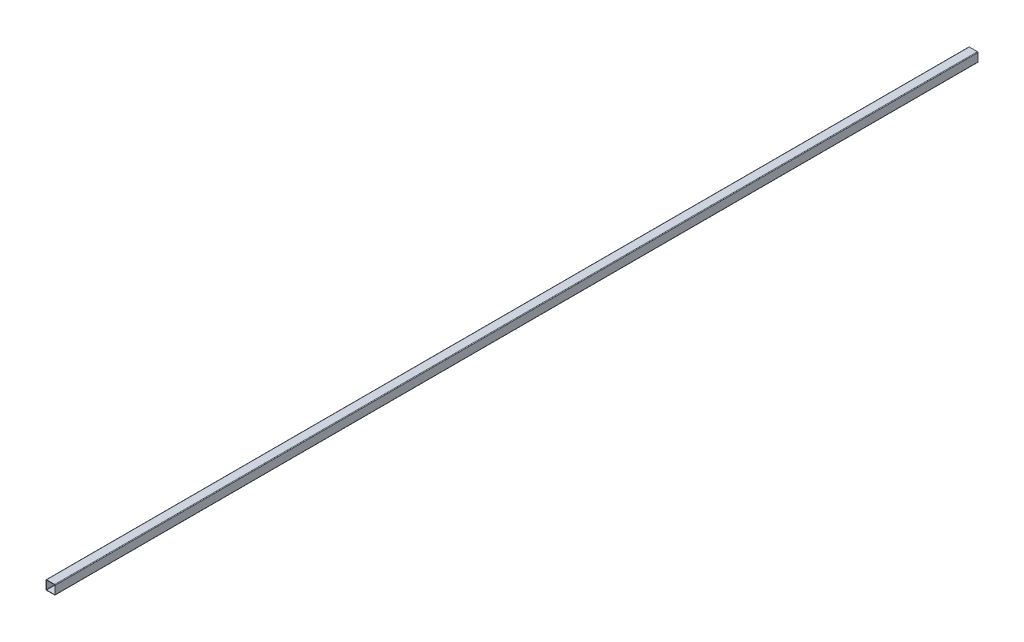
ISO-10303-21;
HEADER;
FILE_DESCRIPTION(('STEP AP214'),'2;1');
FILE_NAME('part.step','',(''),(''),'','','');
FILE_SCHEMA(('AUTOMOTIVE_DESIGN { 1 0 10303 214 1 1 1 1 }'));
ENDSEC;
DATA;
#1=APPLICATION_CONTEXT('core data for automotive mechanical design processes');
#2=APPLICATION_PROTOCOL_DEFINITION('international standard','automotive_design',2000,#1);
#3=PRODUCT_CONTEXT('',#1,'mechanical');
#4=PRODUCT('Part','Part','',(#3));
#5=PRODUCT_RELATED_PRODUCT_CATEGORY('part','',(#4));
#6=PRODUCT_DEFINITION_FORMATION('','',#4);
#7=PRODUCT_DEFINITION_CONTEXT('part definition',#1,'design');
#8=PRODUCT_DEFINITION('design','',#6,#7);
#9=PRODUCT_DEFINITION_SHAPE('','',#8);
#10=(LENGTH_UNIT() NAMED_UNIT(*) SI_UNIT(.MILLI.,.METRE.));
#11=(NAMED_UNIT(*) PLANE_ANGLE_UNIT() SI_UNIT($,.RADIAN.));
#12=(NAMED_UNIT(*) SI_UNIT($,.STERADIAN.) SOLID_ANGLE_UNIT());
#13=UNCERTAINTY_MEASURE_WITH_UNIT(LENGTH_MEASURE(1.E-05),#10,'distance_accuracy_value','');
#14=(GEOMETRIC_REPRESENTATION_CONTEXT(3) GLOBAL_UNCERTAINTY_ASSIGNED_CONTEXT((#13)) GLOBAL_UNIT_ASSIGNED_CONTEXT((#10,
#11,#12)) REPRESENTATION_CONTEXT('',''));
#15=CARTESIAN_POINT('',(0.,0.,0.));
#16=DIRECTION('',(0.,0.,1.));
#17=DIRECTION('',(1.,0.,0.));
#18=AXIS2_PLACEMENT_3D('',#15,#16,#17);
#19=CARTESIAN_POINT('',(-13.,-13.,3000.));
#20=DIRECTION('',(0.,0.,1.));
#21=DIRECTION('',(1.,0.,0.));
#22=AXIS2_PLACEMENT_3D('',#19,#20,#21);
#23=PLANE('',#22);
#24=CARTESIAN_POINT('',(-13.,-13.,3000.));
#25=DIRECTION('',(0.,0.,1.));
#26=DIRECTION('',(1.,0.,0.));
#27=AXIS2_PLACEMENT_3D('',#24,#25,#26);
#28=CIRCLE('',#27,1.99999999999999);
#29=CARTESIAN_POINT('',(-15.,-13.,3000.));
#30=VERTEX_POINT('',#29);
#31=CARTESIAN_POINT('',(-13.,-15.,3000.));
#32=VERTEX_POINT('',#31);
#33=EDGE_CURVE('E242',#30,#32,#28,.T.);
#34=ORIENTED_EDGE('',*,*,#33,.T.);
#35=DIRECTION('',(1.,0.,0.));
#36=VECTOR('',#35,1.);
#37=CARTESIAN_POINT('',(-13.,-15.,3000.));
#38=LINE('',#37,#36);
#39=CARTESIAN_POINT('',(13.,-15.,3000.));
#40=VERTEX_POINT('',#39);
#41=EDGE_CURVE('E246',#32,#40,#38,.T.);
#42=ORIENTED_EDGE('',*,*,#41,.T.);
#43=CARTESIAN_POINT('',(13.,-13.,3000.));
#44=DIRECTION('',(0.,0.,1.));
#45=DIRECTION('',(1.,0.,0.));
#46=AXIS2_PLACEMENT_3D('',#43,#44,#45);
#47=CIRCLE('',#46,1.99999999999998);
#48=CARTESIAN_POINT('',(15.,-13.,3000.));
#49=VERTEX_POINT('',#48);
#50=EDGE_CURVE('E250',#40,#49,#47,.T.);
#51=ORIENTED_EDGE('',*,*,#50,.T.);
#52=DIRECTION('',(0.,1.,0.));
#53=VECTOR('',#52,1.);
#54=CARTESIAN_POINT('',(15.,13.,3000.));
#55=LINE('',#54,#53);
#56=CARTESIAN_POINT('',(15.,13.,3000.));
#57=VERTEX_POINT('',#56);
#58=EDGE_CURVE('E253',#49,#57,#55,.T.);
#59=ORIENTED_EDGE('',*,*,#58,.T.);
#60=CARTESIAN_POINT('',(13.,13.,3000.));
#61=DIRECTION('',(0.,0.,1.));
#62=DIRECTION('',(-1.,0.,0.));
#63=AXIS2_PLACEMENT_3D('',#60,#61,#62);
#64=CIRCLE('',#63,1.99999999999998);
#65=CARTESIAN_POINT('',(13.,15.,3000.));
#66=VERTEX_POINT('',#65);
#67=EDGE_CURVE('E256',#57,#66,#64,.T.);
#68=ORIENTED_EDGE('',*,*,#67,.T.);
#69=DIRECTION('',(-1.,0.,0.));
#70=VECTOR('',#69,1.);
#71=CARTESIAN_POINT('',(-13.,15.,3000.));
#72=LINE('',#71,#70);
#73=CARTESIAN_POINT('',(-13.,15.,3000.));
#74=VERTEX_POINT('',#73);
#75=EDGE_CURVE('E259',#66,#74,#72,.T.);
#76=ORIENTED_EDGE('',*,*,#75,.T.);
#77=CARTESIAN_POINT('',(-13.,13.,3000.));
#78=DIRECTION('',(0.,0.,1.));
#79=DIRECTION('',(1.,0.,0.));
#80=AXIS2_PLACEMENT_3D('',#77,#78,#79);
#81=CIRCLE('',#80,2.);
#82=CARTESIAN_POINT('',(-15.,13.,3000.));
#83=VERTEX_POINT('',#82);
#84=EDGE_CURVE('E262',#74,#83,#81,.T.);
#85=ORIENTED_EDGE('',*,*,#84,.T.);
#86=DIRECTION('',(0.,-1.,0.));
#87=VECTOR('',#86,1.);
#88=CARTESIAN_POINT('',(-15.,13.,3000.));
#89=LINE('',#88,#87);
#90=EDGE_CURVE('E265',#83,#30,#89,.T.);
#91=ORIENTED_EDGE('',*,*,#90,.T.);
#92=EDGE_LOOP('',(#34,#42,#51,#59,#68,#76,#85,#91));
#93=FACE_BOUND('',#92,.T.);
#94=DIRECTION('',(1.,0.,0.));
#95=VECTOR('',#94,1.);
#96=CARTESIAN_POINT('',(-13.,-14.,3000.));
#97=LINE('',#96,#95);
#98=CARTESIAN_POINT('',(-13.,-14.,3000.));
#99=VERTEX_POINT('',#98);
#100=CARTESIAN_POINT('',(13.,-14.,3000.));
#101=VERTEX_POINT('',#100);
#102=EDGE_CURVE('E162',#99,#101,#97,.T.);
#103=ORIENTED_EDGE('',*,*,#102,.F.);
#104=CARTESIAN_POINT('',(-13.,-13.,3000.));
#105=DIRECTION('',(0.,0.,1.));
#106=DIRECTION('',(1.,0.,0.));
#107=AXIS2_PLACEMENT_3D('',#104,#105,#106);
#108=CIRCLE('',#107,0.999999999999997);
#109=CARTESIAN_POINT('',(-14.,-13.,3000.));
#110=VERTEX_POINT('',#109);
#111=EDGE_CURVE('E153',#110,#99,#108,.T.);
#112=ORIENTED_EDGE('',*,*,#111,.F.);
#113=DIRECTION('',(0.,-1.,0.));
#114=VECTOR('',#113,1.);
#115=CARTESIAN_POINT('',(-14.,13.,3000.));
#116=LINE('',#115,#114);
#117=CARTESIAN_POINT('',(-14.,13.,3000.));
#118=VERTEX_POINT('',#117);
#119=EDGE_CURVE('E194',#118,#110,#116,.T.);
#120=ORIENTED_EDGE('',*,*,#119,.F.);
#121=CARTESIAN_POINT('',(-13.,13.,3000.));
#122=DIRECTION('',(0.,0.,1.));
#123=DIRECTION('',(1.,0.,0.));
#124=AXIS2_PLACEMENT_3D('',#121,#122,#123);
#125=CIRCLE('',#124,1.00000000000002);
#126=CARTESIAN_POINT('',(-13.,14.,3000.));
#127=VERTEX_POINT('',#126);
#128=EDGE_CURVE('E191',#127,#118,#125,.T.);
#129=ORIENTED_EDGE('',*,*,#128,.F.);
#130=DIRECTION('',(-1.,0.,0.));
#131=VECTOR('',#130,1.);
#132=CARTESIAN_POINT('',(-13.,14.,3000.));
#133=LINE('',#132,#131);
#134=CARTESIAN_POINT('',(13.,14.,3000.));
#135=VERTEX_POINT('',#134);
#136=EDGE_CURVE('E188',#135,#127,#133,.T.);
#137=ORIENTED_EDGE('',*,*,#136,.F.);
#138=CARTESIAN_POINT('',(13.,13.,3000.));
#139=DIRECTION('',(0.,0.,1.));
#140=DIRECTION('',(-1.,0.,0.));
#141=AXIS2_PLACEMENT_3D('',#138,#139,#140);
#142=CIRCLE('',#141,1.00000000000003);
#143=CARTESIAN_POINT('',(14.,13.,3000.));
#144=VERTEX_POINT('',#143);
#145=EDGE_CURVE('E185',#144,#135,#142,.T.);
#146=ORIENTED_EDGE('',*,*,#145,.F.);
#147=DIRECTION('',(0.,1.,0.));
#148=VECTOR('',#147,1.);
#149=CARTESIAN_POINT('',(14.,13.,3000.));
#150=LINE('',#149,#148);
#151=CARTESIAN_POINT('',(14.,-13.,3000.));
#152=VERTEX_POINT('',#151);
#153=EDGE_CURVE('E180',#152,#144,#150,.T.);
#154=ORIENTED_EDGE('',*,*,#153,.F.);
#155=CARTESIAN_POINT('',(13.,-13.,3000.));
#156=DIRECTION('',(0.,0.,1.));
#157=DIRECTION('',(1.,0.,0.));
#158=AXIS2_PLACEMENT_3D('',#155,#156,#157);
#159=CIRCLE('',#158,1.00000000000002);
#160=EDGE_CURVE('E176',#101,#152,#159,.T.);
#161=ORIENTED_EDGE('',*,*,#160,.F.);
#162=EDGE_LOOP('',(#103,#112,#120,#129,#137,#146,#154,#161));
#163=FACE_BOUND('',#162,.T.);
#164=ADVANCED_FACE('F39',(#93,#163),#23,.T.);
#165=CARTESIAN_POINT('',(-13.,-13.,0.));
#166=DIRECTION('',(0.,0.,1.));
#167=DIRECTION('',(1.,0.,0.));
#168=AXIS2_PLACEMENT_3D('',#165,#166,#167);
#169=PLANE('',#168);
#170=CARTESIAN_POINT('',(-13.,-13.,0.));
#171=DIRECTION('',(0.,0.,1.));
#172=DIRECTION('',(1.,0.,0.));
#173=AXIS2_PLACEMENT_3D('',#170,#171,#172);
#174=CIRCLE('',#173,1.99999999999999);
#175=CARTESIAN_POINT('',(-15.,-13.,0.));
#176=VERTEX_POINT('',#175);
#177=CARTESIAN_POINT('',(-13.,-15.,0.));
#178=VERTEX_POINT('',#177);
#179=EDGE_CURVE('E171',#176,#178,#174,.T.);
#180=ORIENTED_EDGE('',*,*,#179,.F.);
#181=DIRECTION('',(0.,-1.,0.));
#182=VECTOR('',#181,1.);
#183=CARTESIAN_POINT('',(-15.,13.,0.));
#184=LINE('',#183,#182);
#185=CARTESIAN_POINT('',(-15.,13.,0.));
#186=VERTEX_POINT('',#185);
#187=EDGE_CURVE('E247',#186,#176,#184,.T.);
#188=ORIENTED_EDGE('',*,*,#187,.F.);
#189=CARTESIAN_POINT('',(-13.,13.,0.));
#190=DIRECTION('',(0.,0.,1.));
#191=DIRECTION('',(1.,0.,0.));
#192=AXIS2_PLACEMENT_3D('',#189,#190,#191);
#193=CIRCLE('',#192,2.);
#194=CARTESIAN_POINT('',(-13.,15.,0.));
#195=VERTEX_POINT('',#194);
#196=EDGE_CURVE('E287',#195,#186,#193,.T.);
#197=ORIENTED_EDGE('',*,*,#196,.F.);
#198=DIRECTION('',(-1.,0.,0.));
#199=VECTOR('',#198,1.);
#200=CARTESIAN_POINT('',(-13.,15.,0.));
#201=LINE('',#200,#199);
#202=CARTESIAN_POINT('',(13.,15.,0.));
#203=VERTEX_POINT('',#202);
#204=EDGE_CURVE('E284',#203,#195,#201,.T.);
#205=ORIENTED_EDGE('',*,*,#204,.F.);
#206=CARTESIAN_POINT('',(13.,13.,0.));
#207=DIRECTION('',(0.,0.,1.));
#208=DIRECTION('',(-1.,0.,0.));
#209=AXIS2_PLACEMENT_3D('',#206,#207,#208);
#210=CIRCLE('',#209,1.99999999999998);
#211=CARTESIAN_POINT('',(15.,13.,0.));
#212=VERTEX_POINT('',#211);
#213=EDGE_CURVE('E281',#212,#203,#210,.T.);
#214=ORIENTED_EDGE('',*,*,#213,.F.);
#215=DIRECTION('',(0.,1.,0.));
#216=VECTOR('',#215,1.);
#217=CARTESIAN_POINT('',(15.,13.,0.));
#218=LINE('',#217,#216);
#219=CARTESIAN_POINT('',(15.,-13.,0.));
#220=VERTEX_POINT('',#219);
#221=EDGE_CURVE('E278',#220,#212,#218,.T.);
#222=ORIENTED_EDGE('',*,*,#221,.F.);
#223=CARTESIAN_POINT('',(13.,-13.,0.));
#224=DIRECTION('',(0.,0.,1.));
#225=DIRECTION('',(1.,0.,0.));
#226=AXIS2_PLACEMENT_3D('',#223,#224,#225);
#227=CIRCLE('',#226,1.99999999999998);
#228=CARTESIAN_POINT('',(13.,-15.,0.));
#229=VERTEX_POINT('',#228);
#230=EDGE_CURVE('E275',#229,#220,#227,.T.);
#231=ORIENTED_EDGE('',*,*,#230,.F.);
#232=DIRECTION('',(1.,0.,0.));
#233=VECTOR('',#232,1.);
#234=CARTESIAN_POINT('',(-13.,-15.,0.));
#235=LINE('',#234,#233);
#236=EDGE_CURVE('E272',#178,#229,#235,.T.);
#237=ORIENTED_EDGE('',*,*,#236,.F.);
#238=EDGE_LOOP('',(#180,#188,#197,#205,#214,#222,#231,#237));
#239=FACE_BOUND('',#238,.T.);
#240=CARTESIAN_POINT('',(-13.,-13.,0.));
#241=DIRECTION('',(0.,0.,1.));
#242=DIRECTION('',(1.,0.,0.));
#243=AXIS2_PLACEMENT_3D('',#240,#241,#242);
#244=CIRCLE('',#243,0.999999999999997);
#245=CARTESIAN_POINT('',(-14.,-13.,0.));
#246=VERTEX_POINT('',#245);
#247=CARTESIAN_POINT('',(-13.,-14.,0.));
#248=VERTEX_POINT('',#247);
#249=EDGE_CURVE('E63',#246,#248,#244,.T.);
#250=ORIENTED_EDGE('',*,*,#249,.T.);
#251=DIRECTION('',(1.,0.,0.));
#252=VECTOR('',#251,1.);
#253=CARTESIAN_POINT('',(-13.,-14.,0.));
#254=LINE('',#253,#252);
#255=CARTESIAN_POINT('',(13.,-14.,0.));
#256=VERTEX_POINT('',#255);
#257=EDGE_CURVE('E169',#248,#256,#254,.T.);
#258=ORIENTED_EDGE('',*,*,#257,.T.);
#259=CARTESIAN_POINT('',(13.,-13.,0.));
#260=DIRECTION('',(0.,0.,1.));
#261=DIRECTION('',(1.,0.,0.));
#262=AXIS2_PLACEMENT_3D('',#259,#260,#261);
#263=CIRCLE('',#262,1.00000000000002);
#264=CARTESIAN_POINT('',(14.,-13.,0.));
#265=VERTEX_POINT('',#264);
#266=EDGE_CURVE('E201',#256,#265,#263,.T.);
#267=ORIENTED_EDGE('',*,*,#266,.T.);
#268=DIRECTION('',(0.,1.,0.));
#269=VECTOR('',#268,1.);
#270=CARTESIAN_POINT('',(14.,13.,0.));
#271=LINE('',#270,#269);
#272=CARTESIAN_POINT('',(14.,13.,0.));
#273=VERTEX_POINT('',#272);
#274=EDGE_CURVE('E205',#265,#273,#271,.T.);
#275=ORIENTED_EDGE('',*,*,#274,.T.);
#276=CARTESIAN_POINT('',(13.,13.,0.));
#277=DIRECTION('',(0.,0.,1.));
#278=DIRECTION('',(-1.,0.,0.));
#279=AXIS2_PLACEMENT_3D('',#276,#277,#278);
#280=CIRCLE('',#279,1.00000000000003);
#281=CARTESIAN_POINT('',(13.,14.,0.));
#282=VERTEX_POINT('',#281);
#283=EDGE_CURVE('E209',#273,#282,#280,.T.);
#284=ORIENTED_EDGE('',*,*,#283,.T.);
#285=DIRECTION('',(-1.,0.,0.));
#286=VECTOR('',#285,1.);
#287=CARTESIAN_POINT('',(-13.,14.,0.));
#288=LINE('',#287,#286);
#289=CARTESIAN_POINT('',(-13.,14.,0.));
#290=VERTEX_POINT('',#289);
#291=EDGE_CURVE('E213',#282,#290,#288,.T.);
#292=ORIENTED_EDGE('',*,*,#291,.T.);
#293=CARTESIAN_POINT('',(-13.,13.,0.));
#294=DIRECTION('',(0.,0.,1.));
#295=DIRECTION('',(1.,0.,0.));
#296=AXIS2_PLACEMENT_3D('',#293,#294,#295);
#297=CIRCLE('',#296,1.00000000000002);
#298=CARTESIAN_POINT('',(-14.,13.,0.));
#299=VERTEX_POINT('',#298);
#300=EDGE_CURVE('E217',#290,#299,#297,.T.);
#301=ORIENTED_EDGE('',*,*,#300,.T.);
#302=DIRECTION('',(0.,-1.,0.));
#303=VECTOR('',#302,1.);
#304=CARTESIAN_POINT('',(-14.,13.,0.));
#305=LINE('',#304,#303);
#306=EDGE_CURVE('E163',#299,#246,#305,.T.);
#307=ORIENTED_EDGE('',*,*,#306,.T.);
#308=EDGE_LOOP('',(#250,#258,#267,#275,#284,#292,#301,#307));
#309=FACE_BOUND('',#308,.T.);
#310=ADVANCED_FACE('F326',(#239,#309),#169,.F.);
#311=CARTESIAN_POINT('',(-13.,-13.,3000.));
#312=DIRECTION('',(0.,0.,-1.));
#313=DIRECTION('',(-1.,0.,0.));
#314=AXIS2_PLACEMENT_3D('',#311,#312,#313);
#315=CYLINDRICAL_SURFACE('',#314,1.99999999999999);
#316=ORIENTED_EDGE('',*,*,#179,.T.);
#317=DIRECTION('',(0.,0.,-1.));
#318=VECTOR('',#317,1.);
#319=CARTESIAN_POINT('',(-13.,-15.,3000.));
#320=LINE('',#319,#318);
#321=EDGE_CURVE('E11',#32,#178,#320,.T.);
#322=ORIENTED_EDGE('',*,*,#321,.F.);
#323=ORIENTED_EDGE('',*,*,#33,.F.);
#324=DIRECTION('',(0.,0.,-1.));
#325=VECTOR('',#324,1.);
#326=CARTESIAN_POINT('',(-15.,-13.,3000.));
#327=LINE('',#326,#325);
#328=EDGE_CURVE('E268',#30,#176,#327,.T.);
#329=ORIENTED_EDGE('',*,*,#328,.T.);
#330=EDGE_LOOP('',(#316,#322,#323,#329));
#331=FACE_BOUND('',#330,.T.);
#332=ADVANCED_FACE('F41',(#331),#315,.T.);
#333=CARTESIAN_POINT('',(-13.,-15.,3000.));
#334=DIRECTION('',(0.,1.,0.));
#335=DIRECTION('',(0.,0.,1.));
#336=AXIS2_PLACEMENT_3D('',#333,#334,#335);
#337=PLANE('',#336);
#338=ORIENTED_EDGE('',*,*,#236,.T.);
#339=DIRECTION('',(0.,0.,-1.));
#340=VECTOR('',#339,1.);
#341=CARTESIAN_POINT('',(13.,-15.,3000.));
#342=LINE('',#341,#340);
#343=EDGE_CURVE('E48',#40,#229,#342,.T.);
#344=ORIENTED_EDGE('',*,*,#343,.F.);
#345=ORIENTED_EDGE('',*,*,#41,.F.);
#346=ORIENTED_EDGE('',*,*,#321,.T.);
#347=EDGE_LOOP('',(#338,#344,#345,#346));
#348=FACE_BOUND('',#347,.T.);
#349=ADVANCED_FACE('F343',(#348),#337,.F.);
#350=CARTESIAN_POINT('',(13.,-13.,3000.));
#351=DIRECTION('',(0.,0.,-1.));
#352=DIRECTION('',(-1.,0.,0.));
#353=AXIS2_PLACEMENT_3D('',#350,#351,#352);
#354=CYLINDRICAL_SURFACE('',#353,1.99999999999998);
#355=ORIENTED_EDGE('',*,*,#230,.T.);
#356=DIRECTION('',(0.,0.,-1.));
#357=VECTOR('',#356,1.);
#358=CARTESIAN_POINT('',(15.,-13.,3000.));
#359=LINE('',#358,#357);
#360=EDGE_CURVE('E311',#49,#220,#359,.T.);
#361=ORIENTED_EDGE('',*,*,#360,.F.);
#362=ORIENTED_EDGE('',*,*,#50,.F.);
#363=ORIENTED_EDGE('',*,*,#343,.T.);
#364=EDGE_LOOP('',(#355,#361,#362,#363));
#365=FACE_BOUND('',#364,.T.);
#366=ADVANCED_FACE('F320',(#365),#354,.T.);
#367=CARTESIAN_POINT('',(15.,13.,3000.));
#368=DIRECTION('',(-1.,0.,0.));
#369=DIRECTION('',(0.,0.,1.));
#370=AXIS2_PLACEMENT_3D('',#367,#368,#369);
#371=PLANE('',#370);
#372=ORIENTED_EDGE('',*,*,#221,.T.);
#373=DIRECTION('',(0.,0.,-1.));
#374=VECTOR('',#373,1.);
#375=CARTESIAN_POINT('',(15.,13.,3000.));
#376=LINE('',#375,#374);
#377=EDGE_CURVE('E307',#57,#212,#376,.T.);
#378=ORIENTED_EDGE('',*,*,#377,.F.);
#379=ORIENTED_EDGE('',*,*,#58,.F.);
#380=ORIENTED_EDGE('',*,*,#360,.T.);
#381=EDGE_LOOP('',(#372,#378,#379,#380));
#382=FACE_BOUND('',#381,.T.);
#383=ADVANCED_FACE('F332',(#382),#371,.F.);
#384=CARTESIAN_POINT('',(13.,13.,3000.));
#385=DIRECTION('',(0.,0.,-1.));
#386=DIRECTION('',(-1.,0.,0.));
#387=AXIS2_PLACEMENT_3D('',#384,#385,#386);
#388=CYLINDRICAL_SURFACE('',#387,1.99999999999998);
#389=ORIENTED_EDGE('',*,*,#213,.T.);
#390=DIRECTION('',(0.,0.,-1.));
#391=VECTOR('',#390,1.);
#392=CARTESIAN_POINT('',(13.,15.,3000.));
#393=LINE('',#392,#391);
#394=EDGE_CURVE('E303',#66,#203,#393,.T.);
#395=ORIENTED_EDGE('',*,*,#394,.F.);
#396=ORIENTED_EDGE('',*,*,#67,.F.);
#397=ORIENTED_EDGE('',*,*,#377,.T.);
#398=EDGE_LOOP('',(#389,#395,#396,#397));
#399=FACE_BOUND('',#398,.T.);
#400=ADVANCED_FACE('F336',(#399),#388,.T.);
#401=CARTESIAN_POINT('',(-13.,15.,3000.));
#402=DIRECTION('',(0.,-1.,0.));
#403=DIRECTION('',(0.,0.,-1.));
#404=AXIS2_PLACEMENT_3D('',#401,#402,#403);
#405=PLANE('',#404);
#406=ORIENTED_EDGE('',*,*,#204,.T.);
#407=DIRECTION('',(0.,0.,-1.));
#408=VECTOR('',#407,1.);
#409=CARTESIAN_POINT('',(-13.,15.,3000.));
#410=LINE('',#409,#408);
#411=EDGE_CURVE('E299',#74,#195,#410,.T.);
#412=ORIENTED_EDGE('',*,*,#411,.F.);
#413=ORIENTED_EDGE('',*,*,#75,.F.);
#414=ORIENTED_EDGE('',*,*,#394,.T.);
#415=EDGE_LOOP('',(#406,#412,#413,#414));
#416=FACE_BOUND('',#415,.T.);
#417=ADVANCED_FACE('F356',(#416),#405,.F.);
#418=CARTESIAN_POINT('',(-13.,13.,3000.));
#419=DIRECTION('',(0.,0.,-1.));
#420=DIRECTION('',(-1.,0.,0.));
#421=AXIS2_PLACEMENT_3D('',#418,#419,#420);
#422=CYLINDRICAL_SURFACE('',#421,2.);
#423=ORIENTED_EDGE('',*,*,#196,.T.);
#424=DIRECTION('',(0.,0.,-1.));
#425=VECTOR('',#424,1.);
#426=CARTESIAN_POINT('',(-15.,13.,3000.));
#427=LINE('',#426,#425);
#428=EDGE_CURVE('E295',#83,#186,#427,.T.);
#429=ORIENTED_EDGE('',*,*,#428,.F.);
#430=ORIENTED_EDGE('',*,*,#84,.F.);
#431=ORIENTED_EDGE('',*,*,#411,.T.);
#432=EDGE_LOOP('',(#423,#429,#430,#431));
#433=FACE_BOUND('',#432,.T.);
#434=ADVANCED_FACE('F354',(#433),#422,.T.);
#435=CARTESIAN_POINT('',(-15.,13.,3000.));
#436=DIRECTION('',(1.,0.,0.));
#437=DIRECTION('',(0.,0.,-1.));
#438=AXIS2_PLACEMENT_3D('',#435,#436,#437);
#439=PLANE('',#438);
#440=ORIENTED_EDGE('',*,*,#187,.T.);
#441=ORIENTED_EDGE('',*,*,#328,.F.);
#442=ORIENTED_EDGE('',*,*,#90,.F.);
#443=ORIENTED_EDGE('',*,*,#428,.T.);
#444=EDGE_LOOP('',(#440,#441,#442,#443));
#445=FACE_BOUND('',#444,.T.);
#446=ADVANCED_FACE('F349',(#445),#439,.F.);
#447=CARTESIAN_POINT('',(-13.,-13.,3000.));
#448=DIRECTION('',(0.,0.,-1.));
#449=DIRECTION('',(-1.,0.,0.));
#450=AXIS2_PLACEMENT_3D('',#447,#448,#449);
#451=CYLINDRICAL_SURFACE('',#450,0.999999999999997);
#452=ORIENTED_EDGE('',*,*,#249,.F.);
#453=DIRECTION('',(0.,0.,-1.));
#454=VECTOR('',#453,1.);
#455=CARTESIAN_POINT('',(-14.,-13.,3000.));
#456=LINE('',#455,#454);
#457=EDGE_CURVE('E157',#110,#246,#456,.T.);
#458=ORIENTED_EDGE('',*,*,#457,.F.);
#459=ORIENTED_EDGE('',*,*,#111,.T.);
#460=DIRECTION('',(0.,0.,-1.));
#461=VECTOR('',#460,1.);
#462=CARTESIAN_POINT('',(-13.,-14.,3000.));
#463=LINE('',#462,#461);
#464=EDGE_CURVE('E156',#99,#248,#463,.T.);
#465=ORIENTED_EDGE('',*,*,#464,.T.);
#466=EDGE_LOOP('',(#452,#458,#459,#465));
#467=FACE_BOUND('',#466,.T.);
#468=ADVANCED_FACE('F155',(#467),#451,.F.);
#469=CARTESIAN_POINT('',(-13.,-14.,3000.));
#470=DIRECTION('',(0.,1.,0.));
#471=DIRECTION('',(0.,0.,1.));
#472=AXIS2_PLACEMENT_3D('',#469,#470,#471);
#473=PLANE('',#472);
#474=ORIENTED_EDGE('',*,*,#257,.F.);
#475=ORIENTED_EDGE('',*,*,#464,.F.);
#476=ORIENTED_EDGE('',*,*,#102,.T.);
#477=DIRECTION('',(0.,0.,-1.));
#478=VECTOR('',#477,1.);
#479=CARTESIAN_POINT('',(13.,-14.,3000.));
#480=LINE('',#479,#478);
#481=EDGE_CURVE('E172',#101,#256,#480,.T.);
#482=ORIENTED_EDGE('',*,*,#481,.T.);
#483=EDGE_LOOP('',(#474,#475,#476,#482));
#484=FACE_BOUND('',#483,.T.);
#485=ADVANCED_FACE('F166',(#484),#473,.T.);
#486=CARTESIAN_POINT('',(13.,-13.,3000.));
#487=DIRECTION('',(0.,0.,-1.));
#488=DIRECTION('',(-1.,0.,0.));
#489=AXIS2_PLACEMENT_3D('',#486,#487,#488);
#490=CYLINDRICAL_SURFACE('',#489,1.00000000000002);
#491=ORIENTED_EDGE('',*,*,#266,.F.);
#492=ORIENTED_EDGE('',*,*,#481,.F.);
#493=ORIENTED_EDGE('',*,*,#160,.T.);
#494=DIRECTION('',(0.,0.,-1.));
#495=VECTOR('',#494,1.);
#496=CARTESIAN_POINT('',(14.,-13.,3000.));
#497=LINE('',#496,#495);
#498=EDGE_CURVE('E237',#152,#265,#497,.T.);
#499=ORIENTED_EDGE('',*,*,#498,.T.);
#500=EDGE_LOOP('',(#491,#492,#493,#499));
#501=FACE_BOUND('',#500,.T.);
#502=ADVANCED_FACE('F381',(#501),#490,.F.);
#503=CARTESIAN_POINT('',(14.,13.,3000.));
#504=DIRECTION('',(-1.,0.,0.));
#505=DIRECTION('',(0.,0.,1.));
#506=AXIS2_PLACEMENT_3D('',#503,#504,#505);
#507=PLANE('',#506);
#508=ORIENTED_EDGE('',*,*,#274,.F.);
#509=ORIENTED_EDGE('',*,*,#498,.F.);
#510=ORIENTED_EDGE('',*,*,#153,.T.);
#511=DIRECTION('',(0.,0.,-1.));
#512=VECTOR('',#511,1.);
#513=CARTESIAN_POINT('',(14.,13.,3000.));
#514=LINE('',#513,#512);
#515=EDGE_CURVE('E234',#144,#273,#514,.T.);
#516=ORIENTED_EDGE('',*,*,#515,.T.);
#517=EDGE_LOOP('',(#508,#509,#510,#516));
#518=FACE_BOUND('',#517,.T.);
#519=ADVANCED_FACE('F385',(#518),#507,.T.);
#520=CARTESIAN_POINT('',(13.,13.,3000.));
#521=DIRECTION('',(0.,0.,-1.));
#522=DIRECTION('',(-1.,0.,0.));
#523=AXIS2_PLACEMENT_3D('',#520,#521,#522);
#524=CYLINDRICAL_SURFACE('',#523,1.00000000000003);
#525=ORIENTED_EDGE('',*,*,#283,.F.);
#526=ORIENTED_EDGE('',*,*,#515,.F.);
#527=ORIENTED_EDGE('',*,*,#145,.T.);
#528=DIRECTION('',(0.,0.,-1.));
#529=VECTOR('',#528,1.);
#530=CARTESIAN_POINT('',(13.,14.,3000.));
#531=LINE('',#530,#529);
#532=EDGE_CURVE('E231',#135,#282,#531,.T.);
#533=ORIENTED_EDGE('',*,*,#532,.T.);
#534=EDGE_LOOP('',(#525,#526,#527,#533));
#535=FACE_BOUND('',#534,.T.);
#536=ADVANCED_FACE('F391',(#535),#524,.F.);
#537=CARTESIAN_POINT('',(-13.,14.,3000.));
#538=DIRECTION('',(0.,-1.,0.));
#539=DIRECTION('',(0.,0.,-1.));
#540=AXIS2_PLACEMENT_3D('',#537,#538,#539);
#541=PLANE('',#540);
#542=ORIENTED_EDGE('',*,*,#291,.F.);
#543=ORIENTED_EDGE('',*,*,#532,.F.);
#544=ORIENTED_EDGE('',*,*,#136,.T.);
#545=DIRECTION('',(0.,0.,-1.));
#546=VECTOR('',#545,1.);
#547=CARTESIAN_POINT('',(-13.,14.,3000.));
#548=LINE('',#547,#546);
#549=EDGE_CURVE('E228',#127,#290,#548,.T.);
#550=ORIENTED_EDGE('',*,*,#549,.T.);
#551=EDGE_LOOP('',(#542,#543,#544,#550));
#552=FACE_BOUND('',#551,.T.);
#553=ADVANCED_FACE('F395',(#552),#541,.T.);
#554=CARTESIAN_POINT('',(-13.,13.,3000.));
#555=DIRECTION('',(0.,0.,-1.));
#556=DIRECTION('',(-1.,0.,0.));
#557=AXIS2_PLACEMENT_3D('',#554,#555,#556);
#558=CYLINDRICAL_SURFACE('',#557,1.00000000000002);
#559=ORIENTED_EDGE('',*,*,#300,.F.);
#560=ORIENTED_EDGE('',*,*,#549,.F.);
#561=ORIENTED_EDGE('',*,*,#128,.T.);
#562=DIRECTION('',(0.,0.,-1.));
#563=VECTOR('',#562,1.);
#564=CARTESIAN_POINT('',(-14.,13.,3000.));
#565=LINE('',#564,#563);
#566=EDGE_CURVE('E55',#118,#299,#565,.T.);
#567=ORIENTED_EDGE('',*,*,#566,.T.);
#568=EDGE_LOOP('',(#559,#560,#561,#567));
#569=FACE_BOUND('',#568,.T.);
#570=ADVANCED_FACE('F399',(#569),#558,.F.);
#571=CARTESIAN_POINT('',(-14.,13.,3000.));
#572=DIRECTION('',(1.,0.,0.));
#573=DIRECTION('',(0.,0.,-1.));
#574=AXIS2_PLACEMENT_3D('',#571,#572,#573);
#575=PLANE('',#574);
#576=ORIENTED_EDGE('',*,*,#306,.F.);
#577=ORIENTED_EDGE('',*,*,#566,.F.);
#578=ORIENTED_EDGE('',*,*,#119,.T.);
#579=ORIENTED_EDGE('',*,*,#457,.T.);
#580=EDGE_LOOP('',(#576,#577,#578,#579));
#581=FACE_BOUND('',#580,.T.);
#582=ADVANCED_FACE('F403',(#581),#575,.T.);
#583=CLOSED_SHELL('',(#164,#310,#332,#349,#366,#383,#400,#417,#434,#446,#468,#485,#502,#519,
#536,#553,#570,#582));
#584=MANIFOLD_SOLID_BREP('B2',#583);
#585=ADVANCED_BREP_SHAPE_REPRESENTATION('',(#18,#584),#14);
#586=SHAPE_DEFINITION_REPRESENTATION(#9,#585);
ENDSEC;
END-ISO-10303-21;
